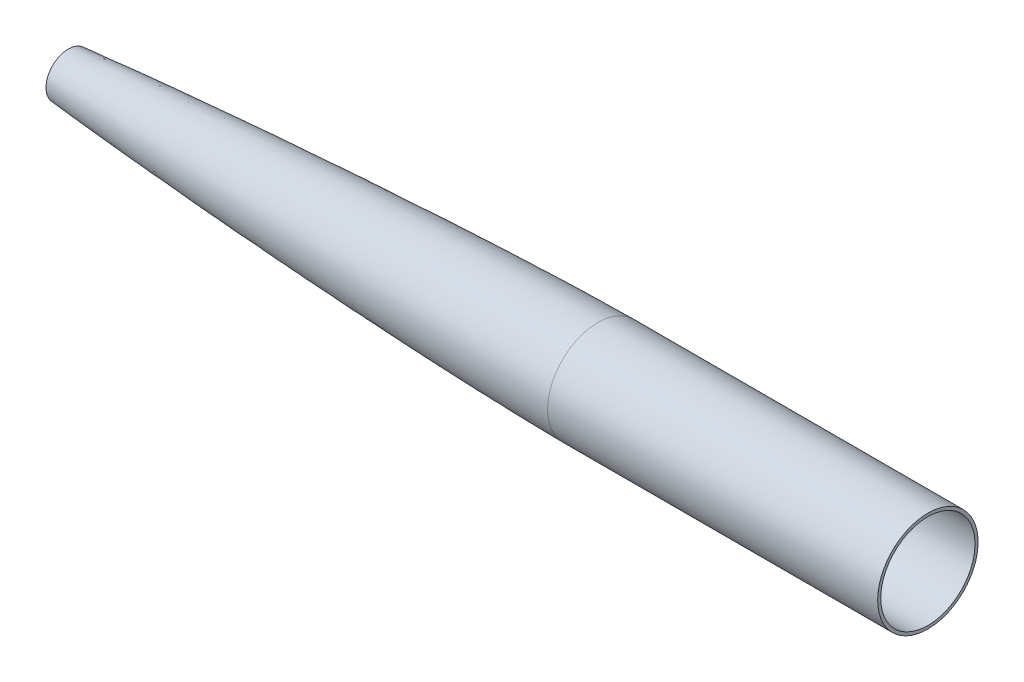
ISO-10303-21;
HEADER;
FILE_DESCRIPTION(('STEP AP214'),'2;1');
FILE_NAME('part.step','',(''),(''),'','','');
FILE_SCHEMA(('AUTOMOTIVE_DESIGN { 1 0 10303 214 1 1 1 1 }'));
ENDSEC;
DATA;
#1=APPLICATION_CONTEXT('core data for automotive mechanical design processes');
#2=APPLICATION_PROTOCOL_DEFINITION('international standard','automotive_design',2000,#1);
#3=PRODUCT_CONTEXT('',#1,'mechanical');
#4=PRODUCT('Part','Part','',(#3));
#5=PRODUCT_RELATED_PRODUCT_CATEGORY('part','',(#4));
#6=PRODUCT_DEFINITION_FORMATION('','',#4);
#7=PRODUCT_DEFINITION_CONTEXT('part definition',#1,'design');
#8=PRODUCT_DEFINITION('design','',#6,#7);
#9=PRODUCT_DEFINITION_SHAPE('','',#8);
#10=(LENGTH_UNIT() NAMED_UNIT(*) SI_UNIT(.MILLI.,.METRE.));
#11=(NAMED_UNIT(*) PLANE_ANGLE_UNIT() SI_UNIT($,.RADIAN.));
#12=(NAMED_UNIT(*) SI_UNIT($,.STERADIAN.) SOLID_ANGLE_UNIT());
#13=UNCERTAINTY_MEASURE_WITH_UNIT(LENGTH_MEASURE(1.E-05),#10,'distance_accuracy_value','');
#14=(GEOMETRIC_REPRESENTATION_CONTEXT(3) GLOBAL_UNCERTAINTY_ASSIGNED_CONTEXT((#13)) GLOBAL_UNIT_ASSIGNED_CONTEXT((#10,
#11,#12)) REPRESENTATION_CONTEXT('',''));
#15=CARTESIAN_POINT('',(0.,0.,0.));
#16=DIRECTION('',(0.,0.,1.));
#17=DIRECTION('',(1.,0.,0.));
#18=AXIS2_PLACEMENT_3D('',#15,#16,#17);
#19=CARTESIAN_POINT('',(95.758,0.,0.));
#20=DIRECTION('',(1.,0.,0.));
#21=DIRECTION('',(0.,0.,-1.));
#22=AXIS2_PLACEMENT_3D('',#19,#20,#21);
#23=PLANE('',#22);
#24=CARTESIAN_POINT('',(95.7579999999999,0.,0.));
#25=DIRECTION('',(-1.,0.,0.));
#26=DIRECTION('',(0.,0.,1.));
#27=AXIS2_PLACEMENT_3D('',#24,#25,#26);
#28=CIRCLE('',#27,10.3482218213229);
#29=CARTESIAN_POINT('',(95.7579999999999,0.,10.3482218213229));
#30=VERTEX_POINT('',#29);
#31=EDGE_CURVE('E11',#30,#30,#28,.F.);
#32=ORIENTED_EDGE('',*,*,#31,.T.);
#33=EDGE_LOOP('',(#32));
#34=FACE_BOUND('',#33,.T.);
#35=CARTESIAN_POINT('',(95.758,0.,0.));
#36=DIRECTION('',(-1.,0.,0.));
#37=DIRECTION('',(0.,0.,1.));
#38=AXIS2_PLACEMENT_3D('',#35,#36,#37);
#39=CIRCLE('',#38,12.0056571352657);
#40=CARTESIAN_POINT('',(95.758,0.,12.0056571352657));
#41=VERTEX_POINT('',#40);
#42=EDGE_CURVE('E47',#41,#41,#39,.F.);
#43=ORIENTED_EDGE('',*,*,#42,.F.);
#44=EDGE_LOOP('',(#43));
#45=FACE_BOUND('',#44,.T.);
#46=ADVANCED_FACE('F44',(#34,#45),#23,.F.);
#47=CARTESIAN_POINT('',(558.8,0.,0.));
#48=DIRECTION('',(-1.,0.,0.));
#49=DIRECTION('',(0.,0.,1.));
#50=AXIS2_PLACEMENT_3D('',#47,#48,#49);
#51=PLANE('',#50);
#52=CARTESIAN_POINT('',(558.8,0.,0.));
#53=DIRECTION('',(-1.,0.,0.));
#54=DIRECTION('',(0.,0.,1.));
#55=AXIS2_PLACEMENT_3D('',#52,#53,#54);
#56=CIRCLE('',#55,25.4000000000001);
#57=CARTESIAN_POINT('',(558.8,0.,25.4000000000001));
#58=VERTEX_POINT('',#57);
#59=EDGE_CURVE('E63',#58,#58,#56,.T.);
#60=ORIENTED_EDGE('',*,*,#59,.T.);
#61=EDGE_LOOP('',(#60));
#62=FACE_BOUND('',#61,.T.);
#63=CARTESIAN_POINT('',(558.8,0.,0.));
#64=DIRECTION('',(-1.,0.,0.));
#65=DIRECTION('',(0.,0.,1.));
#66=AXIS2_PLACEMENT_3D('',#63,#64,#65);
#67=CIRCLE('',#66,27.0510000000002);
#68=CARTESIAN_POINT('',(558.8,0.,27.0510000000002));
#69=VERTEX_POINT('',#68);
#70=EDGE_CURVE('E56',#69,#69,#67,.T.);
#71=ORIENTED_EDGE('',*,*,#70,.F.);
#72=EDGE_LOOP('',(#71));
#73=FACE_BOUND('',#72,.T.);
#74=ADVANCED_FACE('F77',(#62,#73),#51,.F.);
#75=CARTESIAN_POINT('',(0.,0.,0.));
#76=DIRECTION('',(-1.,0.,0.));
#77=DIRECTION('',(0.,0.,1.));
#78=AXIS2_PLACEMENT_3D('',#75,#76,#77);
#79=CYLINDRICAL_SURFACE('',#78,25.4000000000001);
#80=CARTESIAN_POINT('',(381.004131223793,0.,25.4000051686968));
#81=CARTESIAN_POINT('',(381.004131223794,-0.415607032415106,25.4000139847535));
#82=CARTESIAN_POINT('',(381.004131223794,-0.831213314670176,25.3898049615992));
#83=CARTESIAN_POINT('',(381.004131223794,-1.66142504846453,25.3490145385618));
#84=CARTESIAN_POINT('',(381.004131223794,-2.07603050000387,25.3184331386798));
#85=CARTESIAN_POINT('',(381.004131223795,-2.90324124203242,25.2369612638787));
#86=CARTESIAN_POINT('',(381.004131223797,-3.31584653252156,25.186070788959));
#87=CARTESIAN_POINT('',(381.004131223794,-4.13806308668658,25.0641061427491));
#88=CARTESIAN_POINT('',(381.00413122379,-4.54767435036241,24.9930319714586));
#89=CARTESIAN_POINT('',(381.004131223787,-5.36291602483986,24.8308704117775));
#90=CARTESIAN_POINT('',(381.004131223789,-5.76854643564206,24.7397830233898));
#91=CARTESIAN_POINT('',(381.004131223791,-6.5748492151018,24.5378146665188));
#92=CARTESIAN_POINT('',(381.004131223792,-6.97552158375865,24.4269336980327));
#93=CARTESIAN_POINT('',(381.004131223794,-7.77094302140931,24.1856452494765));
#94=CARTESIAN_POINT('',(381.004131223794,-8.16569209040317,24.0552377694067));
#95=CARTESIAN_POINT('',(381.004131223793,-8.94831594435529,23.7752104750486));
#96=CARTESIAN_POINT('',(381.00413122379,-9.33619072931351,23.6255906607602));
#97=CARTESIAN_POINT('',(381.004131223789,-10.1041315907209,23.3074991413449));
#98=CARTESIAN_POINT('',(381.00413122379,-10.484197667169,23.1390274362157));
#99=CARTESIAN_POINT('',(381.004131223794,-11.2356054990194,22.7836379992893));
#100=CARTESIAN_POINT('',(381.004131223796,-11.6069472544232,22.5967202674955));
#101=CARTESIAN_POINT('',(381.004131223797,-12.3400118494201,22.2048890781313));
#102=CARTESIAN_POINT('',(381.004131223796,-12.7017346890134,21.9999756205613));
#103=CARTESIAN_POINT('',(381.004131223795,-13.4146900304359,21.57264663416));
#104=CARTESIAN_POINT('',(381.004131223796,-13.765922532264,21.3502311053268));
#105=CARTESIAN_POINT('',(381.004131223795,-14.4570510482398,20.8884337948979));
#106=CARTESIAN_POINT('',(381.004131223793,-14.796947062388,20.6490520133031));
#107=CARTESIAN_POINT('',(381.004131223789,-15.464583763749,20.1538988890281));
#108=CARTESIAN_POINT('',(381.004131223788,-15.7923244509619,19.8981275463482));
#109=CARTESIAN_POINT('',(381.004131223792,-16.4348609424523,19.3708114754512));
#110=CARTESIAN_POINT('',(381.004131223797,-16.749656746729,19.0992667472333));
#111=CARTESIAN_POINT('',(381.004131223798,-17.3655451016294,18.5410580803377));
#112=CARTESIAN_POINT('',(381.004131223792,-17.6666376522544,18.2543941416615));
#113=CARTESIAN_POINT('',(381.004131223789,-18.2543941415759,17.6666376523435));
#114=CARTESIAN_POINT('',(381.004131223791,-18.5410580802715,17.3655451017007));
#115=CARTESIAN_POINT('',(381.004131223794,-19.0992667471689,16.7496567468017));
#116=CARTESIAN_POINT('',(381.004131223795,-19.3708114753712,16.4348609425459));
#117=CARTESIAN_POINT('',(381.004131223794,-19.8981275462871,15.7923244510402));
#118=CARTESIAN_POINT('',(381.00413122379,-20.1538988889989,15.4645837637889));
#119=CARTESIAN_POINT('',(381.004131223791,-20.6490520132969,14.7969470623958));
#120=CARTESIAN_POINT('',(381.004131223795,-20.8884337948855,14.4570510482558));
#121=CARTESIAN_POINT('',(381.004131223795,-21.3502311053057,13.7659225322983));
#122=CARTESIAN_POINT('',(381.004131223791,-21.5726466341367,13.4146900304803));
#123=CARTESIAN_POINT('',(381.004131223787,-21.9999756205359,12.70173468905));
#124=CARTESIAN_POINT('',(381.004131223787,-22.2048890781045,12.3400118494379));
#125=CARTESIAN_POINT('',(381.00413122379,-22.5967202675273,11.6069472543959));
#126=CARTESIAN_POINT('',(381.004131223792,-22.7836379993807,11.2356054989654));
#127=CARTESIAN_POINT('',(381.004131223792,-23.1390274361788,10.4841976671076));
#128=CARTESIAN_POINT('',(381.004131223789,-23.3074991411229,10.1041315906799));
#129=CARTESIAN_POINT('',(381.00413122379,-23.6255906609922,9.33619072933048));
#130=CARTESIAN_POINT('',(381.004131223793,-23.7752104759186,8.94831594440931));
#131=CARTESIAN_POINT('',(381.004131223794,-24.0552377685173,8.1656920904033));
#132=CARTESIAN_POINT('',(381.004131223793,-24.1856452461908,7.77094302131886));
#133=CARTESIAN_POINT('',(381.004131223791,-24.4269337012675,6.97552158401682));
#134=CARTESIAN_POINT('',(381.004131223789,-24.5378146786692,6.57484921579877));
#135=CARTESIAN_POINT('',(381.004131223792,-24.7397830111984,5.768546435109));
#136=CARTESIAN_POINT('',(381.004131223797,-24.8308703663268,5.36291602263752));
#137=CARTESIAN_POINT('',(381.004131223795,-24.9930320169037,4.54767435259286));
#138=CARTESIAN_POINT('',(381.004131223789,-25.0641063123512,4.13806309501947));
#139=CARTESIAN_POINT('',(381.004131223787,-25.1860706193563,3.31584652419253));
#140=CARTESIAN_POINT('',(381.004131223792,-25.2369606309141,2.903241210939));
#141=CARTESIAN_POINT('',(381.004131223796,-25.3184337716442,2.07603053110015));
#142=CARTESIAN_POINT('',(381.004131223795,-25.3490169008171,1.6614251645149));
#143=CARTESIAN_POINT('',(381.004131223793,-25.389802599344,0.831213198619794));
#144=CARTESIAN_POINT('',(381.004131223793,-25.4000051686968,0.41560659930989));
#145=CARTESIAN_POINT('',(381.004131223793,-25.4000051686968,-0.415606599309912));
#146=CARTESIAN_POINT('',(381.004131223793,-25.389802599344,-0.83121319861981));
#147=CARTESIAN_POINT('',(381.004131223795,-25.3490169008171,-1.66142516451447));
#148=CARTESIAN_POINT('',(381.004131223796,-25.3184337716443,-2.07603053109929));
#149=CARTESIAN_POINT('',(381.004131223793,-25.2369606309109,-2.9032412109716));
#150=CARTESIAN_POINT('',(381.004131223787,-25.1860706193481,-3.31584652425886));
#151=CARTESIAN_POINT('',(381.004131223788,-25.0641063123445,-4.13806309505321));
#152=CARTESIAN_POINT('',(381.004131223795,-24.9930320169084,-4.547674352561));
#153=CARTESIAN_POINT('',(381.004131223796,-24.8308703663483,-5.36291602253763));
#154=CARTESIAN_POINT('',(381.004131223791,-24.7397830112223,-5.76854643500608));
#155=CARTESIAN_POINT('',(381.004131223789,-24.5378146786886,-6.57484921572863));
#156=CARTESIAN_POINT('',(381.004131223792,-24.4269337012781,-6.97552158398202));
#157=CARTESIAN_POINT('',(381.004131223794,-24.1856452461829,-7.77094302134497));
#158=CARTESIAN_POINT('',(381.004131223793,-24.0552377685002,-8.16569209045514));
#159=CARTESIAN_POINT('',(381.004131223794,-23.7752104758902,-8.94831594448459));
#160=CARTESIAN_POINT('',(381.004131223797,-23.6255906609631,-9.33619072940396));
#161=CARTESIAN_POINT('',(381.004131223796,-23.3074991411019,-10.1041315907272));
#162=CARTESIAN_POINT('',(381.004131223792,-23.1390274361677,-10.4841976671309));
#163=CARTESIAN_POINT('',(381.004131223792,-22.7836379993807,-11.2356054989654));
#164=CARTESIAN_POINT('',(381.004131223797,-22.5967202675273,-11.6069472543959));
#165=CARTESIAN_POINT('',(381.004131223797,-22.2048890781002,-12.3400118494459));
#166=CARTESIAN_POINT('',(381.004131223791,-21.9999756205269,-12.7017346890658));
#167=CARTESIAN_POINT('',(381.004131223786,-21.5726466341169,-13.4146900305125));
#168=CARTESIAN_POINT('',(381.004131223787,-21.3502311052796,-13.7659225323389));
#169=CARTESIAN_POINT('',(381.004131223791,-20.8884337948512,-14.4570510483053));
#170=CARTESIAN_POINT('',(381.004131223794,-20.649052013261,-14.796947062446));
#171=CARTESIAN_POINT('',(381.004131223797,-20.1538988889864,-15.4645837638041));
#172=CARTESIAN_POINT('',(381.004131223798,-19.8981275463013,-15.7923244510212));
#173=CARTESIAN_POINT('',(381.004131223793,-19.3708114754171,-16.4348609424917));
#174=CARTESIAN_POINT('',(381.004131223787,-19.0992667472181,-16.7496567467455));
#175=CARTESIAN_POINT('',(381.004131223786,-18.5410580803243,-17.3655451016443));
#176=CARTESIAN_POINT('',(381.004131223791,-18.2543941416288,-17.6666376522888));
#177=CARTESIAN_POINT('',(381.004131223791,-17.6666376522888,-18.2543941416289));
#178=CARTESIAN_POINT('',(381.004131223786,-17.3655451016443,-18.5410580803243));
#179=CARTESIAN_POINT('',(381.004131223788,-16.7496567467621,-19.0992667472031));
#180=CARTESIAN_POINT('',(381.004131223795,-16.4348609425256,-19.3708114753878));
#181=CARTESIAN_POINT('',(381.004131223796,-15.7923244510622,-19.8981275462691));
#182=CARTESIAN_POINT('',(381.004131223791,-15.4645837638336,-20.153898888964));
#183=CARTESIAN_POINT('',(381.004131223791,-14.7969470624186,-20.6490520132817));
#184=CARTESIAN_POINT('',(381.004131223796,-14.4570510482314,-20.8884337949035));
#185=CARTESIAN_POINT('',(381.004131223799,-13.7659225322562,-21.3502311053321));
#186=CARTESIAN_POINT('',(381.004131223798,-13.4146900304705,-21.5726466341421));
#187=CARTESIAN_POINT('',(381.004131223793,-12.7017346890659,-21.9999756205269));
#188=CARTESIAN_POINT('',(381.004131223789,-12.3400118494459,-22.2048890781002));
#189=CARTESIAN_POINT('',(381.004131223788,-11.6069472543677,-22.5967202675424));
#190=CARTESIAN_POINT('',(381.004131223789,-11.2356054989084,-22.7836379994094));
#191=CARTESIAN_POINT('',(381.004131223794,-10.4841976670654,-23.139027436197));
#192=CARTESIAN_POINT('',(381.004131223798,-10.1041315906832,-23.3074991411206));
#193=CARTESIAN_POINT('',(381.004131223798,-9.33619072938147,-23.625590660972));
#194=CARTESIAN_POINT('',(381.004131223795,-8.94831594446151,-23.7752104758989));
#195=CARTESIAN_POINT('',(381.004131223792,-8.16569209040545,-24.0552377685175));
#196=CARTESIAN_POINT('',(381.004131223793,-7.77094302126882,-24.1856452462079));
#197=CARTESIAN_POINT('',(381.004131223793,-6.97552158392101,-24.4269337012948));
#198=CARTESIAN_POINT('',(381.004131223792,-6.57484921571026,-24.5378146786928));
#199=CARTESIAN_POINT('',(381.004131223789,-5.76854643503289,-24.739783011216));
#200=CARTESIAN_POINT('',(381.004131223788,-5.36291602256649,-24.830870366342));
#201=CARTESIAN_POINT('',(381.00413122379,-4.54767435253095,-24.9930320169149));
#202=CARTESIAN_POINT('',(381.004131223794,-4.13806309496159,-25.0641063123607));
#203=CARTESIAN_POINT('',(381.004131223796,-3.31584652414456,-25.1860706193625));
#204=CARTESIAN_POINT('',(381.004131223795,-2.90324121089693,-25.2369606309188));
#205=CARTESIAN_POINT('',(381.004131223794,-2.07603053107009,-25.3184337716465));
#206=CARTESIAN_POINT('',(381.004131223794,-1.66142516449093,-25.3490169008185));
#207=CARTESIAN_POINT('',(381.004131223794,-0.831213198607887,-25.3898025993442));
#208=CARTESIAN_POINT('',(381.004131223793,-0.415606599303941,-25.4000051686968));
#209=CARTESIAN_POINT('',(381.004131223793,0.415606599303836,-25.4000051686968));
#210=CARTESIAN_POINT('',(381.004131223794,0.83121319860767,-25.3898025993443));
#211=CARTESIAN_POINT('',(381.004131223794,1.66142516452579,-25.3490169008168));
#212=CARTESIAN_POINT('',(381.004131223794,2.07603053114006,-25.3184337716414));
#213=CARTESIAN_POINT('',(381.004131223795,2.90324121100142,-25.2369606309068));
#214=CARTESIAN_POINT('',(381.004131223796,3.31584652424863,-25.1860706193488));
#215=CARTESIAN_POINT('',(381.004131223793,4.1380630950287,-25.064106312349));
#216=CARTESIAN_POINT('',(381.00413122379,4.54767435256179,-24.9930320169087));
#217=CARTESIAN_POINT('',(381.004131223787,5.3629160225946,-24.8308703663365));
#218=CARTESIAN_POINT('',(381.004131223789,5.76854643509387,-24.7397830112023));
#219=CARTESIAN_POINT('',(381.004131223792,6.57484921577214,-24.5378146786757));
#220=CARTESIAN_POINT('',(381.004131223792,6.97552158395172,-24.4269337012854));
#221=CARTESIAN_POINT('',(381.004131223794,7.77094302124271,-24.1856452462158));
#222=CARTESIAN_POINT('',(381.004131223794,8.16569209035362,-24.0552377685347));
#223=CARTESIAN_POINT('',(381.004131223793,8.94831594441058,-23.7752104759185));
#224=CARTESIAN_POINT('',(381.004131223791,9.33619072935626,-23.6255906609825));
#225=CARTESIAN_POINT('',(381.00413122379,10.1041315906639,-23.3074991411285));
#226=CARTESIAN_POINT('',(381.004131223791,10.4841976670272,-23.1390274362139));
#227=CARTESIAN_POINT('',(381.004131223793,11.2356054988184,-22.7836379994532));
#228=CARTESIAN_POINT('',(381.004131223795,11.6069472542452,-22.5967202676046));
#229=CARTESIAN_POINT('',(381.004131223796,12.3400118493153,-22.2048890781733));
#230=CARTESIAN_POINT('',(381.004131223795,12.7017346889581,-21.9999756205897));
#231=CARTESIAN_POINT('',(381.004131223795,13.4146900304227,-21.5726466341727));
#232=CARTESIAN_POINT('',(381.004131223797,13.765922532245,-21.3502311053401));
#233=CARTESIAN_POINT('',(381.004131223794,14.4570510482123,-20.8884337949156));
#234=CARTESIAN_POINT('',(381.00413122379,14.7969470623577,-20.6490520133244));
#235=CARTESIAN_POINT('',(381.004131223791,15.4645837637532,-20.1538988890262));
#236=CARTESIAN_POINT('',(381.004131223796,15.7923244510021,-19.8981275463174));
#237=CARTESIAN_POINT('',(381.004131223795,16.434860942501,-19.3708114754091));
#238=CARTESIAN_POINT('',(381.004131223788,16.7496567467528,-19.0992667472117));
#239=CARTESIAN_POINT('',(381.004131223785,17.3655451016294,-18.5410580803377));
#240=CARTESIAN_POINT('',(381.004131223789,17.6666376522544,-18.2543941416615));
#241=CARTESIAN_POINT('',(381.004131223792,18.2543941416094,-17.66663765231));
#242=CARTESIAN_POINT('',(381.004131223791,18.5410580803369,-17.365545101632));
#243=CARTESIAN_POINT('',(381.004131223793,19.0992667472426,-16.7496567467169));
#244=CARTESIAN_POINT('',(381.004131223796,19.3708114754242,-16.4348609424827));
#245=CARTESIAN_POINT('',(381.004131223795,19.8981275463174,-15.7923244510021));
#246=CARTESIAN_POINT('',(381.004131223791,20.1538988890262,-15.4645837637532));
#247=CARTESIAN_POINT('',(381.004131223791,20.6490520133244,-14.7969470623577));
#248=CARTESIAN_POINT('',(381.004131223794,20.8884337949157,-14.4570510482123));
#249=CARTESIAN_POINT('',(381.004131223796,21.350231105325,-13.7659225322677));
#250=CARTESIAN_POINT('',(381.004131223795,21.5726466341435,-13.4146900304687));
#251=CARTESIAN_POINT('',(381.004131223795,21.9999756205543,-12.7017346890197));
#252=CARTESIAN_POINT('',(381.004131223796,22.204889078144,-12.3400118493682));
#253=CARTESIAN_POINT('',(381.004131223795,22.5967202675675,-11.6069472543164));
#254=CARTESIAN_POINT('',(381.004131223793,22.7836379994038,-11.2356054989174));
#255=CARTESIAN_POINT('',(381.004131223791,23.139027436184,-10.4841976670959));
#256=CARTESIAN_POINT('',(381.004131223791,23.3074991411261,-10.1041315906724));
#257=CARTESIAN_POINT('',(381.004131223791,23.6255906609812,-9.33619072935677));
#258=CARTESIAN_POINT('',(381.004131223792,23.7752104758968,-8.9483159444657));
#259=CARTESIAN_POINT('',(381.004131223793,24.055237768518,-8.16569209040588));
#260=CARTESIAN_POINT('',(381.004131223793,24.1856452462192,-7.77094302123549));
#261=CARTESIAN_POINT('',(381.004131223793,24.4269337013042,-6.9755215838859));
#262=CARTESIAN_POINT('',(381.004131223792,24.5378146786928,-6.57484921570812));
#263=CARTESIAN_POINT('',(381.004131223789,24.7397830112096,-5.76854643506052));
#264=CARTESIAN_POINT('',(381.004131223787,24.8308703663369,-5.36291602259046));
#265=CARTESIAN_POINT('',(381.00413122379,24.9930320169113,-4.54767435255087));
#266=CARTESIAN_POINT('',(381.004131223794,25.0641063123575,-4.13806309498116));
#267=CARTESIAN_POINT('',(381.004131223796,25.1860706193551,-3.31584652419686));
#268=CARTESIAN_POINT('',(381.004131223795,25.2369606309084,-2.90324121098255));
#269=CARTESIAN_POINT('',(381.004131223794,25.3184337716405,-2.0760305311518));
#270=CARTESIAN_POINT('',(381.004131223794,25.3490169008163,-1.66142516453507));
#271=CARTESIAN_POINT('',(381.004131223794,25.3898025993441,-0.831213198612212));
#272=CARTESIAN_POINT('',(381.004131223793,25.4000051686968,-0.415606599306107));
#273=CARTESIAN_POINT('',(381.004131223793,25.4000051686968,0.415606599306107));
#274=CARTESIAN_POINT('',(381.004131223794,25.3898025993441,0.831213198612217));
#275=CARTESIAN_POINT('',(381.004131223794,25.349016900818,1.66142516450001));
#276=CARTESIAN_POINT('',(381.004131223794,25.3184337716456,2.07603053108175));
#277=CARTESIAN_POINT('',(381.004131223795,25.236960630917,2.90324121091284));
#278=CARTESIAN_POINT('',(381.004131223797,25.1860706193603,3.31584652416213));
#279=CARTESIAN_POINT('',(381.004131223793,25.0641063123575,4.13806309498116));
#280=CARTESIAN_POINT('',(381.004131223788,24.9930320169113,4.54767435255087));
#281=CARTESIAN_POINT('',(381.004131223789,24.8308703663373,5.36291602258833));
#282=CARTESIAN_POINT('',(381.004131223796,24.7397830112106,5.76854643505629));
#283=CARTESIAN_POINT('',(381.004131223799,24.5378146786763,6.57484921577444));
#284=CARTESIAN_POINT('',(381.004131223795,24.4269337012661,6.97552158402395));
#285=CARTESIAN_POINT('',(381.004131223791,24.1856452461832,7.77094302134174));
#286=CARTESIAN_POINT('',(381.00413122379,24.0552377685144,8.16569209041117));
#287=CARTESIAN_POINT('',(381.004131223794,23.7752104759207,8.94831594440369));
#288=CARTESIAN_POINT('',(381.004131223798,23.625590660994,9.33619072932609));
#289=CARTESIAN_POINT('',(381.004131223797,23.3074991411261,10.1041315906724));
#290=CARTESIAN_POINT('',(381.004131223793,23.139027436184,10.4841976670959));
#291=CARTESIAN_POINT('',(381.004131223791,22.7836379994038,11.2356054989174));
#292=CARTESIAN_POINT('',(381.004131223794,22.5967202675675,11.6069472543164));
#293=CARTESIAN_POINT('',(381.004131223796,22.204889078144,12.3400118493682));
#294=CARTESIAN_POINT('',(381.004131223795,21.9999756205543,12.7017346890197));
#295=CARTESIAN_POINT('',(381.004131223795,21.5726466341435,13.4146900304687));
#296=CARTESIAN_POINT('',(381.004131223796,21.350231105325,13.7659225322677));
#297=CARTESIAN_POINT('',(381.004131223794,20.8884337949156,14.4570510482123));
#298=CARTESIAN_POINT('',(381.004131223792,20.6490520133244,14.7969470623577));
#299=CARTESIAN_POINT('',(381.00413122379,20.1538988890261,15.4645837637533));
#300=CARTESIAN_POINT('',(381.004131223791,19.8981275463173,15.7923244510021));
#301=CARTESIAN_POINT('',(381.004131223789,19.3708114754075,16.4348609425029));
#302=CARTESIAN_POINT('',(381.004131223787,19.0992667472084,16.7496567467565));
#303=CARTESIAN_POINT('',(381.004131223787,18.5410580803343,17.3655451016329));
#304=CARTESIAN_POINT('',(381.004131223789,18.2543941416598,17.6666376522561));
#305=CARTESIAN_POINT('',(381.004131223792,17.6666376523452,18.2543941415742));
#306=CARTESIAN_POINT('',(381.004131223793,17.3655451017043,18.5410580802681));
#307=CARTESIAN_POINT('',(381.004131223792,16.7496567467925,19.0992667471775));
#308=CARTESIAN_POINT('',(381.00413122379,16.4348609425213,19.3708114753926));
#309=CARTESIAN_POINT('',(381.004131223789,15.7923244510183,19.8981275463039));
#310=CARTESIAN_POINT('',(381.00413122379,15.4645837637864,20.153898889));
#311=CARTESIAN_POINT('',(381.004131223792,14.7969470623921,20.6490520133005));
#312=CARTESIAN_POINT('',(381.004131223795,14.4570510482299,20.8884337949052));
#313=CARTESIAN_POINT('',(381.004131223796,13.765922532245,21.3502311053389));
#314=CARTESIAN_POINT('',(381.004131223795,13.4146900304225,21.5726466341682));
#315=CARTESIAN_POINT('',(381.004131223795,12.7017346889583,21.9999756205942));
#316=CARTESIAN_POINT('',(381.004131223796,12.3400118493161,22.2048890781901));
#317=CARTESIAN_POINT('',(381.004131223795,11.6069472543007,22.5967202675577));
#318=CARTESIAN_POINT('',(381.004131223793,11.2356054989294,22.783637999333));
#319=CARTESIAN_POINT('',(381.004131223791,10.4841976671531,23.1390274362221));
#320=CARTESIAN_POINT('',(381.00413122379,10.1041315907467,23.3074991413329));
#321=CARTESIAN_POINT('',(381.004131223791,9.336190729388,23.6255906607306));
#322=CARTESIAN_POINT('',(381.004131223793,8.94831594443596,23.7752104750181));
#323=CARTESIAN_POINT('',(381.004131223794,8.16569209049628,24.055237769375));
#324=CARTESIAN_POINT('',(381.004131223795,7.77094302150867,24.1856452494445));
#325=CARTESIAN_POINT('',(381.004131223792,6.97552158383366,24.4269336980118));
#326=CARTESIAN_POINT('',(381.004131223789,6.57484921514565,24.5378146665076));
#327=CARTESIAN_POINT('',(381.004131223791,5.76854643562695,24.7397830233938));
#328=CARTESIAN_POINT('',(381.004131223797,5.36291602479699,24.8308704117872));
#329=CARTESIAN_POINT('',(381.004131223796,4.54767435029844,24.9930319714701));
#330=CARTESIAN_POINT('',(381.004131223789,4.13806308662961,25.0641061427584));
#331=CARTESIAN_POINT('',(381.004131223787,3.31584653251135,25.1860707889597));
#332=CARTESIAN_POINT('',(381.004131223792,2.90324124206223,25.2369612638746));
#333=CARTESIAN_POINT('',(381.004131223796,2.0760305000445,25.318433138677));
#334=CARTESIAN_POINT('',(381.004131223795,1.66142504847563,25.3490145385616));
#335=CARTESIAN_POINT('',(381.004131223793,0.831213314657825,25.3898049615995));
#336=CARTESIAN_POINT('',(381.004131223791,0.415607032408919,25.4000139847534));
#337=CARTESIAN_POINT('',(381.004131223793,0.,25.4000051686968));
#338=B_SPLINE_CURVE_WITH_KNOTS('',3,(#80,#81,#82,#83,#84,#85,#86,#87,#88,#89,#90,#91,#92,#93,
#94,#95,#96,#97,#98,#99,#100,#101,#102,#103,#104,#105,#106,#107,#108,#109,#110,#111,#112,#113,
#114,#115,#116,#117,#118,#119,#120,#121,#122,#123,#124,#125,#126,#127,#128,#129,#130,#131,#132,
#133,#134,#135,#136,#137,#138,#139,#140,#141,#142,#143,#144,#145,#146,#147,#148,#149,#150,#151,
#152,#153,#154,#155,#156,#157,#158,#159,#160,#161,#162,#163,#164,#165,#166,#167,#168,#169,#170,
#171,#172,#173,#174,#175,#176,#177,#178,#179,#180,#181,#182,#183,#184,#185,#186,#187,#188,#189,
#190,#191,#192,#193,#194,#195,#196,#197,#198,#199,#200,#201,#202,#203,#204,#205,#206,#207,#208,
#209,#210,#211,#212,#213,#214,#215,#216,#217,#218,#219,#220,#221,#222,#223,#224,#225,#226,#227,
#228,#229,#230,#231,#232,#233,#234,#235,#236,#237,#238,#239,#240,#241,#242,#243,#244,#245,#246,
#247,#248,#249,#250,#251,#252,#253,#254,#255,#256,#257,#258,#259,#260,#261,#262,#263,#264,#265,
#266,#267,#268,#269,#270,#271,#272,#273,#274,#275,#276,#277,#278,#279,#280,#281,#282,#283,#284,
#285,#286,#287,#288,#289,#290,#291,#292,#293,#294,#295,#296,#297,#298,#299,#300,#301,#302,#303,
#304,#305,#306,#307,#308,#309,#310,#311,#312,#313,#314,#315,#316,#317,#318,#319,#320,#321,#322,
#323,#324,#325,#326,#327,#328,#329,#330,#331,#332,#333,#334,#335,#336,#337),.UNSPECIFIED.,.F.,
.F.,(4,2,2,2,2,2,2,2,2,2,2,2,2,2,2,2,2,2,2,2,2,2,2,2,2,2,2,2,2,2,2,2,2,2,2,2,2,2,2,2,2,2,2,2,2,
2,2,2,2,2,2,2,2,2,2,2,2,2,2,2,2,2,2,2,2,2,2,2,2,2,2,2,2,2,2,2,2,2,2,2,2,2,2,2,2,2,2,2,2,2,2,2,2,
2,2,2,2,2,2,2,2,2,2,2,2,2,2,2,2,2,2,2,2,2,2,2,2,2,2,2,2,2,2,2,2,2,2,2,4),(0.,1.24669466270366,
2.49338932533322,3.74008398799811,4.98677865068479,6.23347331318931,7.480167975864,
8.72686263852422,9.97355730119103,11.2202519640138,12.4669466266071,13.7136412891692,
14.9603359518603,16.2070306144974,17.4537252771282,18.700419939838,19.9471146024257,
21.1938092650919,22.4405039277238,23.6871985905037,24.9338932531113,26.1805879157683,
27.4272825783939,28.6739772410829,29.92067190381,31.167366566459,32.4140612290357,
33.660755891709,34.9074505543214,36.154145216999,37.4008398796665,38.6475345422977,
39.894229205001,41.1409238677044,42.3876185303342,43.6343131931038,44.881007855582,
46.1277025181839,47.3743971809663,48.6210918436249,49.8677865062696,51.1144811689191,
52.3611758316081,53.6078704942609,54.8545651569495,56.1012598195614,57.347954482211,
58.5946491448317,59.8413438075015,61.0880384701714,62.3347331327248,63.5814277954196,
64.8281224582004,66.0748171207421,67.3215117833949,68.5682064461797,69.8149011087572,
71.0615957714033,72.3082904341443,73.5549850967936,74.8016797593895,76.0483744220544,
77.2950690847038,78.5417637473165,79.788458410002,81.0351530726872,82.2818477354056,
83.5285423980544,84.7752370606094,86.0219317233067,87.2686263858598,88.5153210485189,
89.7620157112469,91.0087103737617,92.2554050364346,93.5020996991623,94.7487943618329,
95.9954890244583,97.2421836872267,98.48887834984,99.7355730124277,100.982267675236,
102.228962337778,103.475657000547,104.722351663172,105.969046325761,107.215740988521,
108.462435651102,109.709130313816,110.955824976369,112.202519639216,113.449214301762,
114.69590896437,115.942603627036,117.189298289585,118.435992952311,119.682687615003,
120.929382277695,122.176076940316,123.42277160297,124.669466265636,125.916160928237,
127.162855591008,128.409550253538,129.656244916191,130.902939578904,132.149634241485,
133.396328904245,134.643023566834,135.889718229459,137.136412892228,138.383107554848,
139.629802217429,140.876496880088,142.123191542779,143.369886205485,144.616580868173,
145.863275530844,147.109970193572,148.356664856053,149.603359518739,150.850054181388,
152.09674884403,153.343443506802,154.590138169391,155.836832832056,157.083527494601,
158.330222157319,159.576916820004),.UNSPECIFIED.);
#339=CARTESIAN_POINT('',(381.004131223793,0.,25.4000051686968));
#340=VERTEX_POINT('',#339);
#341=EDGE_CURVE('E103',#340,#340,#338,.F.);
#342=ORIENTED_EDGE('',*,*,#341,.T.);
#343=EDGE_LOOP('',(#342));
#344=FACE_BOUND('',#343,.T.);
#345=ORIENTED_EDGE('',*,*,#59,.F.);
#346=EDGE_LOOP('',(#345));
#347=FACE_BOUND('',#346,.T.);
#348=ADVANCED_FACE('F80',(#344,#347),#79,.F.);
#349=CARTESIAN_POINT('',(381.,27.051,0.));
#350=CARTESIAN_POINT('',(378.519898254357,27.0447941323733,0.));
#351=CARTESIAN_POINT('',(373.559870392424,26.9977460172186,0.));
#352=CARTESIAN_POINT('',(362.779549534691,26.8366983118141,0.));
#353=CARTESIAN_POINT('',(346.181025115989,26.456332208863,0.));
#354=CARTESIAN_POINT('',(326.24590754355,25.860776049176,0.));
#355=CARTESIAN_POINT('',(297.159015331921,24.794349860732,0.));
#356=CARTESIAN_POINT('',(268.081015451075,23.5051566784336,0.));
#357=CARTESIAN_POINT('',(239.012281644982,22.0230274762085,0.));
#358=CARTESIAN_POINT('',(209.953773421235,20.3548295995155,0.));
#359=CARTESIAN_POINT('',(186.713655963994,18.9084951969484,0.));
#360=CARTESIAN_POINT('',(163.480982982963,17.3469279412174,0.));
#361=CARTESIAN_POINT('',(140.256843139885,15.6630731652763,0.));
#362=CARTESIAN_POINT('',(117.04276839726,13.8452476649641,0.));
#363=CARTESIAN_POINT('',(93.8411520497751,11.8743092402991,0.));
#364=CARTESIAN_POINT('',(70.6557546186802,9.71961734975,0.));
#365=CARTESIAN_POINT('',(49.3274214668385,7.51512258948157,0.));
#366=CARTESIAN_POINT('',(31.4817650469508,5.42673704176586,0.));
#367=CARTESIAN_POINT('',(18.2929547239717,3.63673981003299,0.));
#368=CARTESIAN_POINT('',(10.8969946544614,2.46460849927901,0.));
#369=CARTESIAN_POINT('',(7.44276866143472,1.84108037349423,0.));
#370=CARTESIAN_POINT('',(6.30028829191166,1.62126407414475,0.));
#371=B_SPLINE_CURVE_WITH_KNOTS('',4,(#349,#350,#351,#352,#353,#354,#355,#356,#357,#358,#359,
#360,#361,#362,#363,#364,#365,#366,#367,#368,#369,#370),.UNSPECIFIED.,.F.,.F.,(5,1,1,1,1,1,1,1,
1,1,1,1,1,1,1,1,1,1,5),(0.,0.0259488024389816,0.0518976048779631,0.11280414098761,
0.173710677221486,0.234617213550242,0.356430286434093,0.417336822570343,0.478243358640063,
0.539149894734037,0.600056430830465,0.660962966900997,0.721869502905417,0.782776038791169,
0.84368257456288,0.904589111260775,0.946207283837087,0.9707572328915,0.982930067941195),.UNSPECIFIED.);
#372=CARTESIAN_POINT('',(0.,0.,0.));
#373=DIRECTION('',(-1.,0.,0.));
#374=AXIS1_PLACEMENT('',#372,#373);
#375=SURFACE_OF_REVOLUTION('',#371,#374);
#376=OFFSET_SURFACE('',#375,-1.651,.F.);
#377=ORIENTED_EDGE('',*,*,#31,.F.);
#378=EDGE_LOOP('',(#377));
#379=FACE_BOUND('',#378,.T.);
#380=ORIENTED_EDGE('',*,*,#341,.F.);
#381=EDGE_LOOP('',(#380));
#382=FACE_BOUND('',#381,.T.);
#383=ADVANCED_FACE('F84',(#379,#382),#376,.F.);
#384=CARTESIAN_POINT('',(0.,0.,0.));
#385=DIRECTION('',(-1.,0.,0.));
#386=DIRECTION('',(0.,0.,1.));
#387=AXIS2_PLACEMENT_3D('',#384,#385,#386);
#388=CYLINDRICAL_SURFACE('',#387,27.0510000000001);
#389=CARTESIAN_POINT('',(381.,0.,0.));
#390=DIRECTION('',(-1.,0.,0.));
#391=DIRECTION('',(0.,0.,1.));
#392=AXIS2_PLACEMENT_3D('',#389,#390,#391);
#393=CIRCLE('',#392,27.051);
#394=CARTESIAN_POINT('',(381.,0.,27.051));
#395=VERTEX_POINT('',#394);
#396=EDGE_CURVE('E60',#395,#395,#393,.T.);
#397=ORIENTED_EDGE('',*,*,#396,.F.);
#398=EDGE_LOOP('',(#397));
#399=FACE_BOUND('',#398,.T.);
#400=ORIENTED_EDGE('',*,*,#70,.T.);
#401=EDGE_LOOP('',(#400));
#402=FACE_BOUND('',#401,.T.);
#403=ADVANCED_FACE('F75',(#399,#402),#388,.T.);
#404=CARTESIAN_POINT('',(381.,27.051,0.));
#405=CARTESIAN_POINT('',(378.519898254357,27.0447941323733,0.));
#406=CARTESIAN_POINT('',(373.559870392424,26.9977460172186,0.));
#407=CARTESIAN_POINT('',(362.779549534691,26.8366983118141,0.));
#408=CARTESIAN_POINT('',(346.181025115989,26.456332208863,0.));
#409=CARTESIAN_POINT('',(326.24590754355,25.860776049176,0.));
#410=CARTESIAN_POINT('',(297.159015331921,24.794349860732,0.));
#411=CARTESIAN_POINT('',(268.081015451075,23.5051566784336,0.));
#412=CARTESIAN_POINT('',(239.012281644982,22.0230274762085,0.));
#413=CARTESIAN_POINT('',(209.953773421235,20.3548295995155,0.));
#414=CARTESIAN_POINT('',(186.713655963994,18.9084951969484,0.));
#415=CARTESIAN_POINT('',(163.480982982963,17.3469279412174,0.));
#416=CARTESIAN_POINT('',(140.256843139885,15.6630731652763,0.));
#417=CARTESIAN_POINT('',(117.04276839726,13.8452476649641,0.));
#418=CARTESIAN_POINT('',(93.8411520497751,11.8743092402991,0.));
#419=CARTESIAN_POINT('',(70.6557546186802,9.71961734975,0.));
#420=CARTESIAN_POINT('',(49.3274214668385,7.51512258948157,0.));
#421=CARTESIAN_POINT('',(31.4817650469508,5.42673704176586,0.));
#422=CARTESIAN_POINT('',(18.2314558733856,3.62839313056698,0.));
#423=CARTESIAN_POINT('',(10.1300595164058,2.34292903225525,0.));
#424=CARTESIAN_POINT('',(5.628207544964,1.50807098480229,0.));
#425=CARTESIAN_POINT('',(3.2511009943385,0.99834457614087,0.));
#426=CARTESIAN_POINT('',(1.96991233545836,0.684703022848706,0.));
#427=CARTESIAN_POINT('',(1.25352217055817,0.487162438848417,0.));
#428=CARTESIAN_POINT('',(0.826553697396851,0.356258094596491,0.));
#429=CARTESIAN_POINT('',(0.565487613591443,0.267922607700647,0.));
#430=CARTESIAN_POINT('',(0.387129171174138,0.201635013583111,0.));
#431=CARTESIAN_POINT('',(0.267896859548124,0.152847396420795,0.));
#432=CARTESIAN_POINT('',(0.188790536068569,0.11769789437062,0.));
#433=CARTESIAN_POINT('',(0.122825874984328,0.0853940571983,0.));
#434=CARTESIAN_POINT('',(0.0764034340054884,0.060179709433405,0.));
#435=CARTESIAN_POINT('',(0.041218853831574,0.0381640474727968,0.));
#436=CARTESIAN_POINT('',(0.0170750633415639,0.0199728492708683,0.));
#437=CARTESIAN_POINT('',(0.00610224525341305,0.00952706816180311,0.));
#438=CARTESIAN_POINT('',(0.00184381349247614,0.00332821368710619,0.));
#439=CARTESIAN_POINT('',(0.,0.,0.));
#440=B_SPLINE_CURVE_WITH_KNOTS('',4,(#404,#405,#406,#407,#408,#409,#410,#411,#412,#413,#414,
#415,#416,#417,#418,#419,#420,#421,#422,#423,#424,#425,#426,#427,#428,#429,#430,#431,#432,#433,
#434,#435,#436,#437,#438,#439),.UNSPECIFIED.,.F.,.F.,(5,1,1,1,1,1,1,1,1,1,1,1,1,1,1,1,1,1,1,1,1,
1,1,1,1,1,1,1,1,1,1,1,5),(0.,0.0259488024389816,0.0518976048779631,0.11280414098761,
0.173710677221486,0.234617213550242,0.356430286434093,0.417336822570343,0.478243358640063,
0.539149894734037,0.600056430830465,0.660962966900997,0.721869502905417,0.782776038791169,
0.84368257456288,0.904589111260775,0.946207283837087,0.9707572328915,0.983579372964169,
0.990404647382623,0.994106902289263,0.996190584573806,0.997378199802868,0.998178816898295,
0.998778862272682,0.999073787971116,0.999368713669551,0.999526535252163,0.999684356834775,
0.999842178417388,0.999921089208694,0.999960544604347,1.),.UNSPECIFIED.);
#441=CARTESIAN_POINT('',(0.,0.,0.));
#442=DIRECTION('',(-1.,0.,0.));
#443=AXIS1_PLACEMENT('',#441,#442);
#444=SURFACE_OF_REVOLUTION('',#440,#443);
#445=ORIENTED_EDGE('',*,*,#42,.T.);
#446=EDGE_LOOP('',(#445));
#447=FACE_BOUND('',#446,.T.);
#448=ORIENTED_EDGE('',*,*,#396,.T.);
#449=EDGE_LOOP('',(#448));
#450=FACE_BOUND('',#449,.T.);
#451=ADVANCED_FACE('F72',(#447,#450),#444,.T.);
#452=CLOSED_SHELL('',(#46,#74,#348,#383,#403,#451));
#453=MANIFOLD_SOLID_BREP('B2',#452);
#454=ADVANCED_BREP_SHAPE_REPRESENTATION('',(#18,#453),#14);
#455=SHAPE_DEFINITION_REPRESENTATION(#9,#454);
ENDSEC;
END-ISO-10303-21;
